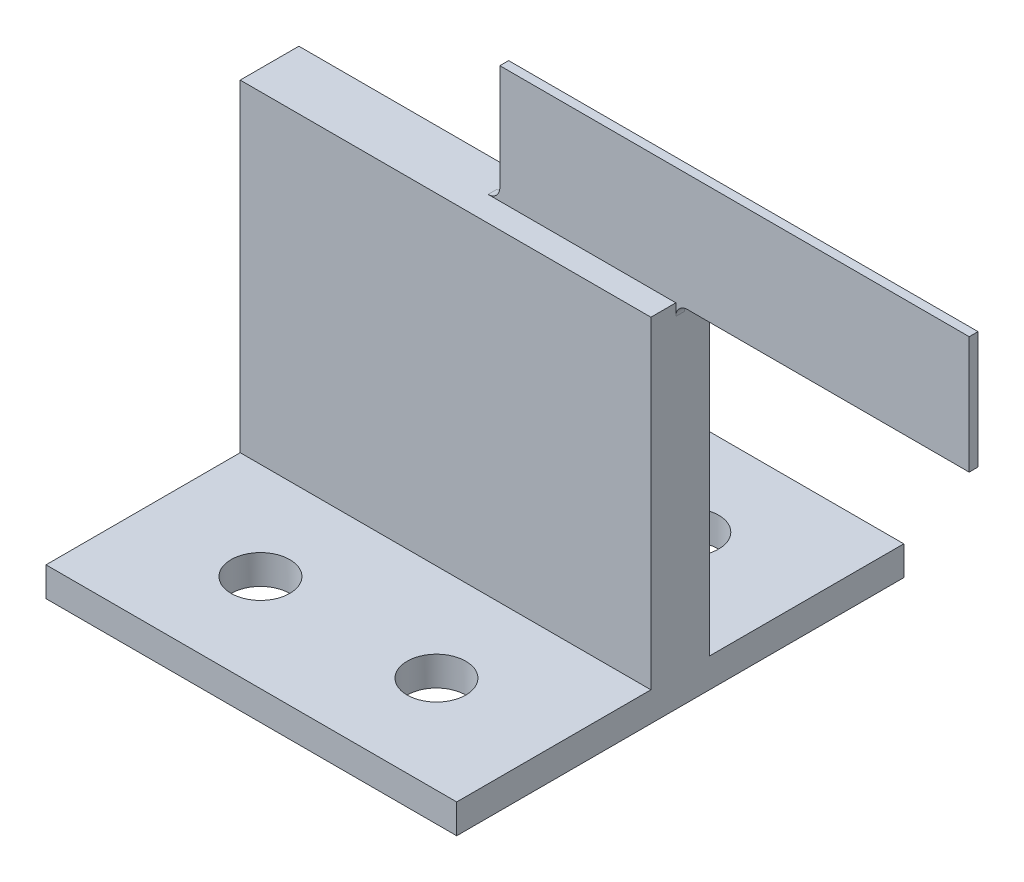
ISO-10303-21;
HEADER;
FILE_DESCRIPTION(('STEP AP214'),'2;1');
FILE_NAME('part.step','',(''),(''),'','','');
FILE_SCHEMA(('AUTOMOTIVE_DESIGN { 1 0 10303 214 1 1 1 1 }'));
ENDSEC;
DATA;
#1=APPLICATION_CONTEXT('core data for automotive mechanical design processes');
#2=APPLICATION_PROTOCOL_DEFINITION('international standard','automotive_design',2000,#1);
#3=PRODUCT_CONTEXT('',#1,'mechanical');
#4=PRODUCT('Part','Part','',(#3));
#5=PRODUCT_RELATED_PRODUCT_CATEGORY('part','',(#4));
#6=PRODUCT_DEFINITION_FORMATION('','',#4);
#7=PRODUCT_DEFINITION_CONTEXT('part definition',#1,'design');
#8=PRODUCT_DEFINITION('design','',#6,#7);
#9=PRODUCT_DEFINITION_SHAPE('','',#8);
#10=(LENGTH_UNIT() NAMED_UNIT(*) SI_UNIT(.MILLI.,.METRE.));
#11=(NAMED_UNIT(*) PLANE_ANGLE_UNIT() SI_UNIT($,.RADIAN.));
#12=(NAMED_UNIT(*) SI_UNIT($,.STERADIAN.) SOLID_ANGLE_UNIT());
#13=UNCERTAINTY_MEASURE_WITH_UNIT(LENGTH_MEASURE(1.E-05),#10,'distance_accuracy_value','');
#14=(GEOMETRIC_REPRESENTATION_CONTEXT(3) GLOBAL_UNCERTAINTY_ASSIGNED_CONTEXT((#13)) GLOBAL_UNIT_ASSIGNED_CONTEXT((#10,
#11,#12)) REPRESENTATION_CONTEXT('',''));
#15=CARTESIAN_POINT('',(0.,0.,0.));
#16=DIRECTION('',(0.,0.,1.));
#17=DIRECTION('',(1.,0.,0.));
#18=AXIS2_PLACEMENT_3D('',#15,#16,#17);
#19=CARTESIAN_POINT('',(17.5,30.,2.5));
#20=DIRECTION('',(0.,0.,-1.));
#21=DIRECTION('',(-1.,0.,0.));
#22=AXIS2_PLACEMENT_3D('',#19,#20,#21);
#23=PLANE('',#22);
#24=DIRECTION('',(-1.,0.,0.));
#25=VECTOR('',#24,1.);
#26=CARTESIAN_POINT('',(17.5,2.5,2.5));
#27=LINE('',#26,#25);
#28=CARTESIAN_POINT('',(17.5,2.5,2.5));
#29=VERTEX_POINT('',#28);
#30=CARTESIAN_POINT('',(-17.5,2.5,2.5));
#31=VERTEX_POINT('',#30);
#32=EDGE_CURVE('E52',#29,#31,#27,.T.);
#33=ORIENTED_EDGE('',*,*,#32,.F.);
#34=DIRECTION('',(0.,-1.,0.));
#35=VECTOR('',#34,1.);
#36=CARTESIAN_POINT('',(17.5,30.,2.5));
#37=LINE('',#36,#35);
#38=CARTESIAN_POINT('',(17.5,30.,2.5));
#39=VERTEX_POINT('',#38);
#40=EDGE_CURVE('E242',#39,#29,#37,.T.);
#41=ORIENTED_EDGE('',*,*,#40,.F.);
#42=DIRECTION('',(1.,0.,0.));
#43=VECTOR('',#42,1.);
#44=CARTESIAN_POINT('',(17.5,30.,2.5));
#45=LINE('',#44,#43);
#46=CARTESIAN_POINT('',(-17.5,30.,2.5));
#47=VERTEX_POINT('',#46);
#48=EDGE_CURVE('E228',#47,#39,#45,.T.);
#49=ORIENTED_EDGE('',*,*,#48,.F.);
#50=DIRECTION('',(0.,-1.,0.));
#51=VECTOR('',#50,1.);
#52=CARTESIAN_POINT('',(-17.5,30.,2.5));
#53=LINE('',#52,#51);
#54=EDGE_CURVE('E48',#47,#31,#53,.T.);
#55=ORIENTED_EDGE('',*,*,#54,.T.);
#56=EDGE_LOOP('',(#33,#41,#49,#55));
#57=FACE_BOUND('',#56,.T.);
#58=ADVANCED_FACE('F33',(#57),#23,.F.);
#59=CARTESIAN_POINT('',(17.5,30.,-2.5));
#60=DIRECTION('',(0.,0.,1.));
#61=DIRECTION('',(1.,0.,0.));
#62=AXIS2_PLACEMENT_3D('',#59,#60,#61);
#63=PLANE('',#62);
#64=DIRECTION('',(1.,0.,0.));
#65=VECTOR('',#64,1.);
#66=CARTESIAN_POINT('',(17.5,2.5,-2.5));
#67=LINE('',#66,#65);
#68=CARTESIAN_POINT('',(-17.5,2.5,-2.5));
#69=VERTEX_POINT('',#68);
#70=CARTESIAN_POINT('',(17.5,2.5,-2.5));
#71=VERTEX_POINT('',#70);
#72=EDGE_CURVE('E11',#69,#71,#67,.T.);
#73=ORIENTED_EDGE('',*,*,#72,.F.);
#74=DIRECTION('',(0.,-1.,0.));
#75=VECTOR('',#74,1.);
#76=CARTESIAN_POINT('',(-17.5,30.,-2.5));
#77=LINE('',#76,#75);
#78=CARTESIAN_POINT('',(-17.5,30.,-2.5));
#79=VERTEX_POINT('',#78);
#80=EDGE_CURVE('E153',#79,#69,#77,.T.);
#81=ORIENTED_EDGE('',*,*,#80,.F.);
#82=DIRECTION('',(-1.,0.,0.));
#83=VECTOR('',#82,1.);
#84=CARTESIAN_POINT('',(17.5,30.,-2.5));
#85=LINE('',#84,#83);
#86=CARTESIAN_POINT('',(17.5,30.,-2.5));
#87=VERTEX_POINT('',#86);
#88=EDGE_CURVE('E235',#87,#79,#85,.T.);
#89=ORIENTED_EDGE('',*,*,#88,.F.);
#90=DIRECTION('',(0.,-1.,0.));
#91=VECTOR('',#90,1.);
#92=CARTESIAN_POINT('',(17.5,30.,-2.5));
#93=LINE('',#92,#91);
#94=EDGE_CURVE('E240',#87,#71,#93,.T.);
#95=ORIENTED_EDGE('',*,*,#94,.T.);
#96=EDGE_LOOP('',(#73,#81,#89,#95));
#97=FACE_BOUND('',#96,.T.);
#98=ADVANCED_FACE('F316',(#97),#63,.F.);
#99=CARTESIAN_POINT('',(-17.5,30.,2.5));
#100=DIRECTION('',(1.,0.,0.));
#101=DIRECTION('',(0.,0.,-1.));
#102=AXIS2_PLACEMENT_3D('',#99,#100,#101);
#103=PLANE('',#102);
#104=DIRECTION('',(0.,0.,1.));
#105=VECTOR('',#104,1.);
#106=CARTESIAN_POINT('',(-17.5,0.,2.5));
#107=LINE('',#106,#105);
#108=CARTESIAN_POINT('',(-17.5,0.,-19.05));
#109=VERTEX_POINT('',#108);
#110=CARTESIAN_POINT('',(-17.5,0.,19.05));
#111=VERTEX_POINT('',#110);
#112=EDGE_CURVE('E224',#109,#111,#107,.T.);
#113=ORIENTED_EDGE('',*,*,#112,.T.);
#114=DIRECTION('',(0.,-1.,0.));
#115=VECTOR('',#114,1.);
#116=CARTESIAN_POINT('',(-17.5,2.5,19.05));
#117=LINE('',#116,#115);
#118=CARTESIAN_POINT('',(-17.5,2.5,19.05));
#119=VERTEX_POINT('',#118);
#120=EDGE_CURVE('E185',#119,#111,#117,.T.);
#121=ORIENTED_EDGE('',*,*,#120,.F.);
#122=DIRECTION('',(0.,0.,-1.));
#123=VECTOR('',#122,1.);
#124=CARTESIAN_POINT('',(-17.5,2.5,-19.05));
#125=LINE('',#124,#123);
#126=EDGE_CURVE('E156',#119,#31,#125,.T.);
#127=ORIENTED_EDGE('',*,*,#126,.T.);
#128=ORIENTED_EDGE('',*,*,#54,.F.);
#129=DIRECTION('',(0.,0.,1.));
#130=VECTOR('',#129,1.);
#131=CARTESIAN_POINT('',(-17.5,30.,2.5));
#132=LINE('',#131,#130);
#133=EDGE_CURVE('E225',#79,#47,#132,.T.);
#134=ORIENTED_EDGE('',*,*,#133,.F.);
#135=ORIENTED_EDGE('',*,*,#80,.T.);
#136=CARTESIAN_POINT('',(-17.5,2.5,-19.05));
#137=VERTEX_POINT('',#136);
#138=EDGE_CURVE('E146',#69,#137,#125,.T.);
#139=ORIENTED_EDGE('',*,*,#138,.T.);
#140=DIRECTION('',(0.,-1.,0.));
#141=VECTOR('',#140,1.);
#142=CARTESIAN_POINT('',(-17.5,2.5,-19.05));
#143=LINE('',#142,#141);
#144=EDGE_CURVE('E149',#137,#109,#143,.T.);
#145=ORIENTED_EDGE('',*,*,#144,.T.);
#146=EDGE_LOOP('',(#113,#121,#127,#128,#134,#135,#139,#145));
#147=FACE_BOUND('',#146,.T.);
#148=ADVANCED_FACE('F148',(#147),#103,.F.);
#149=CARTESIAN_POINT('',(17.5,30.,2.5));
#150=DIRECTION('',(-1.,0.,0.));
#151=DIRECTION('',(0.,0.,1.));
#152=AXIS2_PLACEMENT_3D('',#149,#150,#151);
#153=PLANE('',#152);
#154=DIRECTION('',(0.,0.,-1.));
#155=VECTOR('',#154,1.);
#156=CARTESIAN_POINT('',(17.5,0.,2.5));
#157=LINE('',#156,#155);
#158=CARTESIAN_POINT('',(17.5,0.,19.05));
#159=VERTEX_POINT('',#158);
#160=CARTESIAN_POINT('',(17.5,0.,-19.05));
#161=VERTEX_POINT('',#160);
#162=EDGE_CURVE('E229',#159,#161,#157,.T.);
#163=ORIENTED_EDGE('',*,*,#162,.T.);
#164=DIRECTION('',(0.,-1.,0.));
#165=VECTOR('',#164,1.);
#166=CARTESIAN_POINT('',(17.5,2.5,-19.05));
#167=LINE('',#166,#165);
#168=CARTESIAN_POINT('',(17.5,2.5,-19.05));
#169=VERTEX_POINT('',#168);
#170=EDGE_CURVE('E166',#169,#161,#167,.T.);
#171=ORIENTED_EDGE('',*,*,#170,.F.);
#172=DIRECTION('',(0.,0.,1.));
#173=VECTOR('',#172,1.);
#174=CARTESIAN_POINT('',(17.5,2.5,-19.05));
#175=LINE('',#174,#173);
#176=EDGE_CURVE('E172',#169,#71,#175,.T.);
#177=ORIENTED_EDGE('',*,*,#176,.T.);
#178=ORIENTED_EDGE('',*,*,#94,.F.);
#179=DIRECTION('',(0.,0.,-1.));
#180=VECTOR('',#179,1.);
#181=CARTESIAN_POINT('',(17.5,30.,2.5));
#182=LINE('',#181,#180);
#183=CARTESIAN_POINT('',(17.5,30.,-0.375));
#184=VERTEX_POINT('',#183);
#185=EDGE_CURVE('E231',#184,#87,#182,.T.);
#186=ORIENTED_EDGE('',*,*,#185,.F.);
#187=DIRECTION('',(0.,-1.,0.));
#188=VECTOR('',#187,1.);
#189=CARTESIAN_POINT('',(17.5,40.,-0.374999999999999));
#190=LINE('',#189,#188);
#191=CARTESIAN_POINT('',(17.5,29.,-0.374999999999999));
#192=VERTEX_POINT('',#191);
#193=EDGE_CURVE('E259',#184,#192,#190,.T.);
#194=ORIENTED_EDGE('',*,*,#193,.T.);
#195=DIRECTION('',(0.,0.,-1.));
#196=VECTOR('',#195,1.);
#197=CARTESIAN_POINT('',(17.5,29.,0.375000000000001));
#198=LINE('',#197,#196);
#199=CARTESIAN_POINT('',(17.5,29.,0.375000000000001));
#200=VERTEX_POINT('',#199);
#201=EDGE_CURVE('E256',#192,#200,#198,.F.);
#202=ORIENTED_EDGE('',*,*,#201,.T.);
#203=DIRECTION('',(0.,1.,0.));
#204=VECTOR('',#203,1.);
#205=CARTESIAN_POINT('',(17.5,40.,0.375000000000001));
#206=LINE('',#205,#204);
#207=CARTESIAN_POINT('',(17.5,30.,0.375000000000001));
#208=VERTEX_POINT('',#207);
#209=EDGE_CURVE('E254',#200,#208,#206,.T.);
#210=ORIENTED_EDGE('',*,*,#209,.T.);
#211=EDGE_CURVE('E232',#39,#208,#182,.T.);
#212=ORIENTED_EDGE('',*,*,#211,.F.);
#213=ORIENTED_EDGE('',*,*,#40,.T.);
#214=CARTESIAN_POINT('',(17.5,2.5,19.05));
#215=VERTEX_POINT('',#214);
#216=EDGE_CURVE('E173',#29,#215,#175,.T.);
#217=ORIENTED_EDGE('',*,*,#216,.T.);
#218=DIRECTION('',(0.,-1.,0.));
#219=VECTOR('',#218,1.);
#220=CARTESIAN_POINT('',(17.5,2.5,19.05));
#221=LINE('',#220,#219);
#222=EDGE_CURVE('E188',#215,#159,#221,.T.);
#223=ORIENTED_EDGE('',*,*,#222,.T.);
#224=EDGE_LOOP('',(#163,#171,#177,#178,#186,#194,#202,#210,#212,#213,#217,#223));
#225=FACE_BOUND('',#224,.T.);
#226=ADVANCED_FACE('F284',(#225),#153,.F.);
#227=CARTESIAN_POINT('',(0.,30.,0.));
#228=DIRECTION('',(0.,1.,0.));
#229=DIRECTION('',(0.,0.,1.));
#230=AXIS2_PLACEMENT_3D('',#227,#228,#229);
#231=PLANE('',#230);
#232=DIRECTION('',(1.,0.,0.));
#233=VECTOR('',#232,1.);
#234=CARTESIAN_POINT('',(42.5,30.,0.374999999999998));
#235=LINE('',#234,#233);
#236=CARTESIAN_POINT('',(1.50000000000001,30.,0.375000000000003));
#237=VERTEX_POINT('',#236);
#238=EDGE_CURVE('E205',#237,#208,#235,.T.);
#239=ORIENTED_EDGE('',*,*,#238,.F.);
#240=DIRECTION('',(0.,0.,1.));
#241=VECTOR('',#240,1.);
#242=CARTESIAN_POINT('',(1.50000000000001,30.,0.));
#243=LINE('',#242,#241);
#244=CARTESIAN_POINT('',(1.50000000000001,30.,-0.374999999999997));
#245=VERTEX_POINT('',#244);
#246=EDGE_CURVE('E248',#237,#245,#243,.F.);
#247=ORIENTED_EDGE('',*,*,#246,.T.);
#248=DIRECTION('',(-1.,0.,0.));
#249=VECTOR('',#248,1.);
#250=CARTESIAN_POINT('',(42.5,30.,-0.375000000000002));
#251=LINE('',#250,#249);
#252=EDGE_CURVE('E212',#184,#245,#251,.T.);
#253=ORIENTED_EDGE('',*,*,#252,.F.);
#254=ORIENTED_EDGE('',*,*,#185,.T.);
#255=ORIENTED_EDGE('',*,*,#88,.T.);
#256=ORIENTED_EDGE('',*,*,#133,.T.);
#257=ORIENTED_EDGE('',*,*,#48,.T.);
#258=ORIENTED_EDGE('',*,*,#211,.T.);
#259=EDGE_LOOP('',(#239,#247,#253,#254,#255,#256,#257,#258));
#260=FACE_BOUND('',#259,.T.);
#261=ADVANCED_FACE('F289',(#260),#231,.T.);
#262=CARTESIAN_POINT('',(0.,0.,0.));
#263=DIRECTION('',(0.,1.,0.));
#264=DIRECTION('',(0.,0.,1.));
#265=AXIS2_PLACEMENT_3D('',#262,#263,#264);
#266=PLANE('',#265);
#267=CARTESIAN_POINT('',(-7.49999999999999,0.,10.775));
#268=DIRECTION('',(0.,1.,0.));
#269=DIRECTION('',(0.,0.,1.));
#270=AXIS2_PLACEMENT_3D('',#267,#268,#269);
#271=CIRCLE('',#270,2.5);
#272=CARTESIAN_POINT('',(-7.49999999999999,0.,13.275));
#273=VERTEX_POINT('',#272);
#274=EDGE_CURVE('E353',#273,#273,#271,.F.);
#275=ORIENTED_EDGE('',*,*,#274,.F.);
#276=EDGE_LOOP('',(#275));
#277=FACE_BOUND('',#276,.T.);
#278=CARTESIAN_POINT('',(7.50000000000001,0.,10.775));
#279=DIRECTION('',(0.,1.,0.));
#280=DIRECTION('',(0.,0.,1.));
#281=AXIS2_PLACEMENT_3D('',#278,#279,#280);
#282=CIRCLE('',#281,2.5);
#283=CARTESIAN_POINT('',(7.50000000000001,0.,13.275));
#284=VERTEX_POINT('',#283);
#285=EDGE_CURVE('E357',#284,#284,#282,.F.);
#286=ORIENTED_EDGE('',*,*,#285,.F.);
#287=EDGE_LOOP('',(#286));
#288=FACE_BOUND('',#287,.T.);
#289=CARTESIAN_POINT('',(7.50000000000001,0.,-10.775));
#290=DIRECTION('',(0.,1.,0.));
#291=DIRECTION('',(0.,0.,1.));
#292=AXIS2_PLACEMENT_3D('',#289,#290,#291);
#293=CIRCLE('',#292,2.5);
#294=CARTESIAN_POINT('',(7.50000000000001,0.,-8.275));
#295=VERTEX_POINT('',#294);
#296=EDGE_CURVE('E361',#295,#295,#293,.F.);
#297=ORIENTED_EDGE('',*,*,#296,.F.);
#298=EDGE_LOOP('',(#297));
#299=FACE_BOUND('',#298,.T.);
#300=CARTESIAN_POINT('',(-7.49999999999999,0.,-10.775));
#301=DIRECTION('',(0.,1.,0.));
#302=DIRECTION('',(0.,0.,1.));
#303=AXIS2_PLACEMENT_3D('',#300,#301,#302);
#304=CIRCLE('',#303,2.5);
#305=CARTESIAN_POINT('',(-7.49999999999999,0.,-8.275));
#306=VERTEX_POINT('',#305);
#307=EDGE_CURVE('E182',#306,#306,#304,.F.);
#308=ORIENTED_EDGE('',*,*,#307,.F.);
#309=EDGE_LOOP('',(#308));
#310=FACE_BOUND('',#309,.T.);
#311=ORIENTED_EDGE('',*,*,#112,.F.);
#312=DIRECTION('',(1.,0.,0.));
#313=VECTOR('',#312,1.);
#314=CARTESIAN_POINT('',(17.5,0.,-19.05));
#315=LINE('',#314,#313);
#316=EDGE_CURVE('E165',#109,#161,#315,.T.);
#317=ORIENTED_EDGE('',*,*,#316,.T.);
#318=ORIENTED_EDGE('',*,*,#162,.F.);
#319=DIRECTION('',(-1.,0.,0.));
#320=VECTOR('',#319,1.);
#321=CARTESIAN_POINT('',(17.5,0.,19.05));
#322=LINE('',#321,#320);
#323=EDGE_CURVE('E157',#159,#111,#322,.T.);
#324=ORIENTED_EDGE('',*,*,#323,.T.);
#325=EDGE_LOOP('',(#311,#317,#318,#324));
#326=FACE_BOUND('',#325,.T.);
#327=ADVANCED_FACE('F338',(#277,#288,#299,#310,#326),#266,.F.);
#328=CARTESIAN_POINT('',(0.,30.,0.));
#329=DIRECTION('',(0.,1.,0.));
#330=DIRECTION('',(0.,0.,1.));
#331=AXIS2_PLACEMENT_3D('',#328,#329,#330);
#332=PLANE('',#331);
#333=CARTESIAN_POINT('',(18.5,30.,0.375000000000001));
#334=VERTEX_POINT('',#333);
#335=CARTESIAN_POINT('',(42.5,30.,0.374999999999998));
#336=VERTEX_POINT('',#335);
#337=EDGE_CURVE('E193',#334,#336,#235,.T.);
#338=ORIENTED_EDGE('',*,*,#337,.F.);
#339=DIRECTION('',(0.,0.,-1.));
#340=VECTOR('',#339,1.);
#341=CARTESIAN_POINT('',(18.5,30.,-0.375));
#342=LINE('',#341,#340);
#343=CARTESIAN_POINT('',(18.5,30.,-0.374999999999999));
#344=VERTEX_POINT('',#343);
#345=EDGE_CURVE('E251',#334,#344,#342,.T.);
#346=ORIENTED_EDGE('',*,*,#345,.T.);
#347=CARTESIAN_POINT('',(42.5,30.,-0.375000000000002));
#348=VERTEX_POINT('',#347);
#349=EDGE_CURVE('E198',#348,#344,#251,.T.);
#350=ORIENTED_EDGE('',*,*,#349,.F.);
#351=DIRECTION('',(0.,0.,-1.));
#352=VECTOR('',#351,1.);
#353=CARTESIAN_POINT('',(42.5,30.,0.374999999999998));
#354=LINE('',#353,#352);
#355=EDGE_CURVE('E208',#336,#348,#354,.T.);
#356=ORIENTED_EDGE('',*,*,#355,.F.);
#357=EDGE_LOOP('',(#338,#346,#350,#356));
#358=FACE_BOUND('',#357,.T.);
#359=ADVANCED_FACE('F278',(#358),#332,.F.);
#360=CARTESIAN_POINT('',(2.50000000000001,40.,0.375000000000003));
#361=DIRECTION('',(1.,0.,0.));
#362=DIRECTION('',(0.,0.,-1.));
#363=AXIS2_PLACEMENT_3D('',#360,#361,#362);
#364=PLANE('',#363);
#365=DIRECTION('',(0.,-1.,0.));
#366=VECTOR('',#365,1.);
#367=CARTESIAN_POINT('',(2.50000000000001,40.,-0.374999999999997));
#368=LINE('',#367,#366);
#369=CARTESIAN_POINT('',(2.50000000000001,40.,-0.374999999999997));
#370=VERTEX_POINT('',#369);
#371=CARTESIAN_POINT('',(2.50000000000001,31.,-0.374999999999997));
#372=VERTEX_POINT('',#371);
#373=EDGE_CURVE('E204',#370,#372,#368,.T.);
#374=ORIENTED_EDGE('',*,*,#373,.T.);
#375=DIRECTION('',(0.,0.,1.));
#376=VECTOR('',#375,1.);
#377=CARTESIAN_POINT('',(2.50000000000001,31.,0.375000000000003));
#378=LINE('',#377,#376);
#379=CARTESIAN_POINT('',(2.50000000000001,31.,0.375000000000003));
#380=VERTEX_POINT('',#379);
#381=EDGE_CURVE('E245',#372,#380,#378,.T.);
#382=ORIENTED_EDGE('',*,*,#381,.T.);
#383=DIRECTION('',(0.,-1.,0.));
#384=VECTOR('',#383,1.);
#385=CARTESIAN_POINT('',(2.50000000000001,40.,0.375000000000003));
#386=LINE('',#385,#384);
#387=CARTESIAN_POINT('',(2.50000000000001,40.,0.375000000000003));
#388=VERTEX_POINT('',#387);
#389=EDGE_CURVE('E221',#388,#380,#386,.T.);
#390=ORIENTED_EDGE('',*,*,#389,.F.);
#391=DIRECTION('',(0.,0.,1.));
#392=VECTOR('',#391,1.);
#393=CARTESIAN_POINT('',(2.50000000000001,40.,0.375000000000003));
#394=LINE('',#393,#392);
#395=EDGE_CURVE('E194',#370,#388,#394,.T.);
#396=ORIENTED_EDGE('',*,*,#395,.F.);
#397=EDGE_LOOP('',(#374,#382,#390,#396));
#398=FACE_BOUND('',#397,.T.);
#399=ADVANCED_FACE('F298',(#398),#364,.F.);
#400=CARTESIAN_POINT('',(42.5,40.,0.374999999999998));
#401=DIRECTION('',(0.,0.,-1.));
#402=DIRECTION('',(-1.,0.,0.));
#403=AXIS2_PLACEMENT_3D('',#400,#401,#402);
#404=PLANE('',#403);
#405=ORIENTED_EDGE('',*,*,#238,.T.);
#406=ORIENTED_EDGE('',*,*,#209,.F.);
#407=CARTESIAN_POINT('',(18.5,29.,0.375000000000001));
#408=DIRECTION('',(0.,0.,-1.));
#409=DIRECTION('',(-1.,0.,0.));
#410=AXIS2_PLACEMENT_3D('',#407,#408,#409);
#411=CIRCLE('',#410,1.);
#412=EDGE_CURVE('E41',#200,#334,#411,.T.);
#413=ORIENTED_EDGE('',*,*,#412,.T.);
#414=ORIENTED_EDGE('',*,*,#337,.T.);
#415=DIRECTION('',(0.,-1.,0.));
#416=VECTOR('',#415,1.);
#417=CARTESIAN_POINT('',(42.5,40.,0.374999999999998));
#418=LINE('',#417,#416);
#419=CARTESIAN_POINT('',(42.5,40.,0.374999999999998));
#420=VERTEX_POINT('',#419);
#421=EDGE_CURVE('E218',#420,#336,#418,.T.);
#422=ORIENTED_EDGE('',*,*,#421,.F.);
#423=DIRECTION('',(1.,0.,0.));
#424=VECTOR('',#423,1.);
#425=CARTESIAN_POINT('',(42.5,40.,0.374999999999998));
#426=LINE('',#425,#424);
#427=EDGE_CURVE('E197',#388,#420,#426,.T.);
#428=ORIENTED_EDGE('',*,*,#427,.F.);
#429=ORIENTED_EDGE('',*,*,#389,.T.);
#430=CARTESIAN_POINT('',(1.50000000000001,31.,0.375000000000003));
#431=DIRECTION('',(0.,0.,-1.));
#432=DIRECTION('',(-1.,0.,0.));
#433=AXIS2_PLACEMENT_3D('',#430,#431,#432);
#434=CIRCLE('',#433,1.);
#435=EDGE_CURVE('E262',#380,#237,#434,.T.);
#436=ORIENTED_EDGE('',*,*,#435,.T.);
#437=EDGE_LOOP('',(#405,#406,#413,#414,#422,#428,#429,#436));
#438=FACE_BOUND('',#437,.T.);
#439=ADVANCED_FACE('F271',(#438),#404,.F.);
#440=CARTESIAN_POINT('',(42.5,40.,0.374999999999998));
#441=DIRECTION('',(-1.,0.,0.));
#442=DIRECTION('',(0.,0.,1.));
#443=AXIS2_PLACEMENT_3D('',#440,#441,#442);
#444=PLANE('',#443);
#445=ORIENTED_EDGE('',*,*,#355,.T.);
#446=DIRECTION('',(0.,-1.,0.));
#447=VECTOR('',#446,1.);
#448=CARTESIAN_POINT('',(42.5,40.,-0.375000000000002));
#449=LINE('',#448,#447);
#450=CARTESIAN_POINT('',(42.5,40.,-0.375000000000002));
#451=VERTEX_POINT('',#450);
#452=EDGE_CURVE('E215',#451,#348,#449,.T.);
#453=ORIENTED_EDGE('',*,*,#452,.F.);
#454=DIRECTION('',(0.,0.,-1.));
#455=VECTOR('',#454,1.);
#456=CARTESIAN_POINT('',(42.5,40.,0.374999999999998));
#457=LINE('',#456,#455);
#458=EDGE_CURVE('E200',#420,#451,#457,.T.);
#459=ORIENTED_EDGE('',*,*,#458,.F.);
#460=ORIENTED_EDGE('',*,*,#421,.T.);
#461=EDGE_LOOP('',(#445,#453,#459,#460));
#462=FACE_BOUND('',#461,.T.);
#463=ADVANCED_FACE('F306',(#462),#444,.F.);
#464=CARTESIAN_POINT('',(42.5,40.,-0.375000000000002));
#465=DIRECTION('',(0.,0.,1.));
#466=DIRECTION('',(1.,0.,0.));
#467=AXIS2_PLACEMENT_3D('',#464,#465,#466);
#468=PLANE('',#467);
#469=ORIENTED_EDGE('',*,*,#349,.T.);
#470=CARTESIAN_POINT('',(18.5,29.,-0.374999999999999));
#471=DIRECTION('',(0.,0.,1.));
#472=DIRECTION('',(1.,0.,0.));
#473=AXIS2_PLACEMENT_3D('',#470,#471,#472);
#474=CIRCLE('',#473,1.);
#475=EDGE_CURVE('E267',#344,#192,#474,.T.);
#476=ORIENTED_EDGE('',*,*,#475,.T.);
#477=ORIENTED_EDGE('',*,*,#193,.F.);
#478=ORIENTED_EDGE('',*,*,#252,.T.);
#479=CARTESIAN_POINT('',(1.50000000000001,31.,-0.374999999999997));
#480=DIRECTION('',(0.,0.,1.));
#481=DIRECTION('',(1.,0.,0.));
#482=AXIS2_PLACEMENT_3D('',#479,#480,#481);
#483=CIRCLE('',#482,1.);
#484=EDGE_CURVE('E265',#245,#372,#483,.T.);
#485=ORIENTED_EDGE('',*,*,#484,.T.);
#486=ORIENTED_EDGE('',*,*,#373,.F.);
#487=DIRECTION('',(-1.,0.,0.));
#488=VECTOR('',#487,1.);
#489=CARTESIAN_POINT('',(42.5,40.,-0.375000000000002));
#490=LINE('',#489,#488);
#491=EDGE_CURVE('E202',#451,#370,#490,.T.);
#492=ORIENTED_EDGE('',*,*,#491,.F.);
#493=ORIENTED_EDGE('',*,*,#452,.T.);
#494=EDGE_LOOP('',(#469,#476,#477,#478,#485,#486,#492,#493));
#495=FACE_BOUND('',#494,.T.);
#496=ADVANCED_FACE('F281',(#495),#468,.F.);
#497=CARTESIAN_POINT('',(0.,40.,0.));
#498=DIRECTION('',(0.,1.,0.));
#499=DIRECTION('',(0.,0.,1.));
#500=AXIS2_PLACEMENT_3D('',#497,#498,#499);
#501=PLANE('',#500);
#502=ORIENTED_EDGE('',*,*,#395,.T.);
#503=ORIENTED_EDGE('',*,*,#427,.T.);
#504=ORIENTED_EDGE('',*,*,#458,.T.);
#505=ORIENTED_EDGE('',*,*,#491,.T.);
#506=EDGE_LOOP('',(#502,#503,#504,#505));
#507=FACE_BOUND('',#506,.T.);
#508=ADVANCED_FACE('F303',(#507),#501,.T.);
#509=CARTESIAN_POINT('',(1.50000000000001,31.,0.375000000000003));
#510=DIRECTION('',(0.,0.,1.));
#511=DIRECTION('',(1.,0.,0.));
#512=AXIS2_PLACEMENT_3D('',#509,#510,#511);
#513=CYLINDRICAL_SURFACE('',#512,1.);
#514=ORIENTED_EDGE('',*,*,#484,.F.);
#515=ORIENTED_EDGE('',*,*,#246,.F.);
#516=ORIENTED_EDGE('',*,*,#435,.F.);
#517=ORIENTED_EDGE('',*,*,#381,.F.);
#518=EDGE_LOOP('',(#514,#515,#516,#517));
#519=FACE_BOUND('',#518,.T.);
#520=ADVANCED_FACE('F300',(#519),#513,.F.);
#521=CARTESIAN_POINT('',(18.5,29.,0.));
#522=DIRECTION('',(0.,0.,1.));
#523=DIRECTION('',(1.,0.,0.));
#524=AXIS2_PLACEMENT_3D('',#521,#522,#523);
#525=CYLINDRICAL_SURFACE('',#524,1.);
#526=ORIENTED_EDGE('',*,*,#412,.F.);
#527=ORIENTED_EDGE('',*,*,#201,.F.);
#528=ORIENTED_EDGE('',*,*,#475,.F.);
#529=ORIENTED_EDGE('',*,*,#345,.F.);
#530=EDGE_LOOP('',(#526,#527,#528,#529));
#531=FACE_BOUND('',#530,.T.);
#532=ADVANCED_FACE('F35',(#531),#525,.F.);
#533=CARTESIAN_POINT('',(17.5,2.5,-19.05));
#534=DIRECTION('',(0.,0.,-1.));
#535=DIRECTION('',(-1.,0.,0.));
#536=AXIS2_PLACEMENT_3D('',#533,#534,#535);
#537=PLANE('',#536);
#538=ORIENTED_EDGE('',*,*,#316,.F.);
#539=ORIENTED_EDGE('',*,*,#144,.F.);
#540=DIRECTION('',(1.,0.,0.));
#541=VECTOR('',#540,1.);
#542=CARTESIAN_POINT('',(17.5,2.5,-19.05));
#543=LINE('',#542,#541);
#544=EDGE_CURVE('E163',#137,#169,#543,.T.);
#545=ORIENTED_EDGE('',*,*,#544,.T.);
#546=ORIENTED_EDGE('',*,*,#170,.T.);
#547=EDGE_LOOP('',(#538,#539,#545,#546));
#548=FACE_BOUND('',#547,.T.);
#549=ADVANCED_FACE('F161',(#548),#537,.T.);
#550=CARTESIAN_POINT('',(0.,2.5,0.));
#551=DIRECTION('',(0.,-1.,0.));
#552=DIRECTION('',(0.,0.,-1.));
#553=AXIS2_PLACEMENT_3D('',#550,#551,#552);
#554=PLANE('',#553);
#555=CARTESIAN_POINT('',(7.50000000000001,2.5,-10.775));
#556=DIRECTION('',(0.,1.,0.));
#557=DIRECTION('',(0.,0.,1.));
#558=AXIS2_PLACEMENT_3D('',#555,#556,#557);
#559=CIRCLE('',#558,2.5);
#560=CARTESIAN_POINT('',(7.50000000000001,2.5,-8.275));
#561=VERTEX_POINT('',#560);
#562=EDGE_CURVE('E406',#561,#561,#559,.T.);
#563=ORIENTED_EDGE('',*,*,#562,.F.);
#564=EDGE_LOOP('',(#563));
#565=FACE_BOUND('',#564,.T.);
#566=CARTESIAN_POINT('',(-7.49999999999999,2.5,-10.775));
#567=DIRECTION('',(0.,1.,0.));
#568=DIRECTION('',(0.,0.,1.));
#569=AXIS2_PLACEMENT_3D('',#566,#567,#568);
#570=CIRCLE('',#569,2.5);
#571=CARTESIAN_POINT('',(-7.49999999999999,2.5,-8.275));
#572=VERTEX_POINT('',#571);
#573=EDGE_CURVE('E408',#572,#572,#570,.T.);
#574=ORIENTED_EDGE('',*,*,#573,.F.);
#575=EDGE_LOOP('',(#574));
#576=FACE_BOUND('',#575,.T.);
#577=ORIENTED_EDGE('',*,*,#138,.F.);
#578=ORIENTED_EDGE('',*,*,#72,.T.);
#579=ORIENTED_EDGE('',*,*,#176,.F.);
#580=ORIENTED_EDGE('',*,*,#544,.F.);
#581=EDGE_LOOP('',(#577,#578,#579,#580));
#582=FACE_BOUND('',#581,.T.);
#583=ADVANCED_FACE('F170',(#565,#576,#582),#554,.F.);
#584=CARTESIAN_POINT('',(-7.49999999999999,2.5,10.775));
#585=DIRECTION('',(0.,1.,0.));
#586=DIRECTION('',(0.,0.,-1.));
#587=AXIS2_PLACEMENT_3D('',#584,#585,#586);
#588=CIRCLE('',#587,2.5);
#589=CARTESIAN_POINT('',(-7.49999999999999,2.5,8.275));
#590=VERTEX_POINT('',#589);
#591=EDGE_CURVE('E415',#590,#590,#588,.T.);
#592=ORIENTED_EDGE('',*,*,#591,.F.);
#593=EDGE_LOOP('',(#592));
#594=FACE_BOUND('',#593,.T.);
#595=CARTESIAN_POINT('',(7.50000000000001,2.5,10.775));
#596=DIRECTION('',(0.,1.,0.));
#597=DIRECTION('',(0.,0.,-1.));
#598=AXIS2_PLACEMENT_3D('',#595,#596,#597);
#599=CIRCLE('',#598,2.5);
#600=CARTESIAN_POINT('',(7.50000000000001,2.5,8.275));
#601=VERTEX_POINT('',#600);
#602=EDGE_CURVE('E410',#601,#601,#599,.T.);
#603=ORIENTED_EDGE('',*,*,#602,.F.);
#604=EDGE_LOOP('',(#603));
#605=FACE_BOUND('',#604,.T.);
#606=ORIENTED_EDGE('',*,*,#216,.F.);
#607=ORIENTED_EDGE('',*,*,#32,.T.);
#608=ORIENTED_EDGE('',*,*,#126,.F.);
#609=DIRECTION('',(-1.,0.,0.));
#610=VECTOR('',#609,1.);
#611=CARTESIAN_POINT('',(17.5,2.5,19.05));
#612=LINE('',#611,#610);
#613=EDGE_CURVE('E167',#215,#119,#612,.T.);
#614=ORIENTED_EDGE('',*,*,#613,.F.);
#615=EDGE_LOOP('',(#606,#607,#608,#614));
#616=FACE_BOUND('',#615,.T.);
#617=ADVANCED_FACE('F373',(#594,#605,#616),#554,.F.);
#618=CARTESIAN_POINT('',(17.5,2.5,19.05));
#619=DIRECTION('',(0.,0.,1.));
#620=DIRECTION('',(1.,0.,0.));
#621=AXIS2_PLACEMENT_3D('',#618,#619,#620);
#622=PLANE('',#621);
#623=ORIENTED_EDGE('',*,*,#323,.F.);
#624=ORIENTED_EDGE('',*,*,#222,.F.);
#625=ORIENTED_EDGE('',*,*,#613,.T.);
#626=ORIENTED_EDGE('',*,*,#120,.T.);
#627=EDGE_LOOP('',(#623,#624,#625,#626));
#628=FACE_BOUND('',#627,.T.);
#629=ADVANCED_FACE('F368',(#628),#622,.T.);
#630=CARTESIAN_POINT('',(7.50000000000001,-7.07106781186548,10.775));
#631=DIRECTION('',(0.,1.,0.));
#632=DIRECTION('',(0.,0.,1.));
#633=AXIS2_PLACEMENT_3D('',#630,#631,#632);
#634=CYLINDRICAL_SURFACE('',#633,2.5);
#635=ORIENTED_EDGE('',*,*,#285,.T.);
#636=EDGE_LOOP('',(#635));
#637=FACE_BOUND('',#636,.T.);
#638=ORIENTED_EDGE('',*,*,#602,.T.);
#639=EDGE_LOOP('',(#638));
#640=FACE_BOUND('',#639,.T.);
#641=ADVANCED_FACE('F382',(#637,#640),#634,.F.);
#642=CARTESIAN_POINT('',(-7.49999999999999,-7.07106781186548,10.775));
#643=DIRECTION('',(0.,1.,0.));
#644=DIRECTION('',(0.,0.,1.));
#645=AXIS2_PLACEMENT_3D('',#642,#643,#644);
#646=CYLINDRICAL_SURFACE('',#645,2.5);
#647=ORIENTED_EDGE('',*,*,#274,.T.);
#648=EDGE_LOOP('',(#647));
#649=FACE_BOUND('',#648,.T.);
#650=ORIENTED_EDGE('',*,*,#591,.T.);
#651=EDGE_LOOP('',(#650));
#652=FACE_BOUND('',#651,.T.);
#653=ADVANCED_FACE('F391',(#649,#652),#646,.F.);
#654=CARTESIAN_POINT('',(-7.49999999999999,-7.07106781186548,-10.775));
#655=DIRECTION('',(0.,1.,0.));
#656=DIRECTION('',(0.,0.,1.));
#657=AXIS2_PLACEMENT_3D('',#654,#655,#656);
#658=CYLINDRICAL_SURFACE('',#657,2.5);
#659=ORIENTED_EDGE('',*,*,#307,.T.);
#660=EDGE_LOOP('',(#659));
#661=FACE_BOUND('',#660,.T.);
#662=ORIENTED_EDGE('',*,*,#573,.T.);
#663=EDGE_LOOP('',(#662));
#664=FACE_BOUND('',#663,.T.);
#665=ADVANCED_FACE('F387',(#661,#664),#658,.F.);
#666=CARTESIAN_POINT('',(7.50000000000001,-7.07106781186548,-10.775));
#667=DIRECTION('',(0.,1.,0.));
#668=DIRECTION('',(0.,0.,1.));
#669=AXIS2_PLACEMENT_3D('',#666,#667,#668);
#670=CYLINDRICAL_SURFACE('',#669,2.5);
#671=ORIENTED_EDGE('',*,*,#296,.T.);
#672=EDGE_LOOP('',(#671));
#673=FACE_BOUND('',#672,.T.);
#674=ORIENTED_EDGE('',*,*,#562,.T.);
#675=EDGE_LOOP('',(#674));
#676=FACE_BOUND('',#675,.T.);
#677=ADVANCED_FACE('F390',(#673,#676),#670,.F.);
#678=CLOSED_SHELL('',(#58,#98,#148,#226,#261,#327,#359,#399,#439,#463,#496,#508,#520,#532,#549,
#583,#617,#629,#641,#653,#665,#677));
#679=MANIFOLD_SOLID_BREP('B2',#678);
#680=ADVANCED_BREP_SHAPE_REPRESENTATION('',(#18,#679),#14);
#681=SHAPE_DEFINITION_REPRESENTATION(#9,#680);
ENDSEC;
END-ISO-10303-21;
